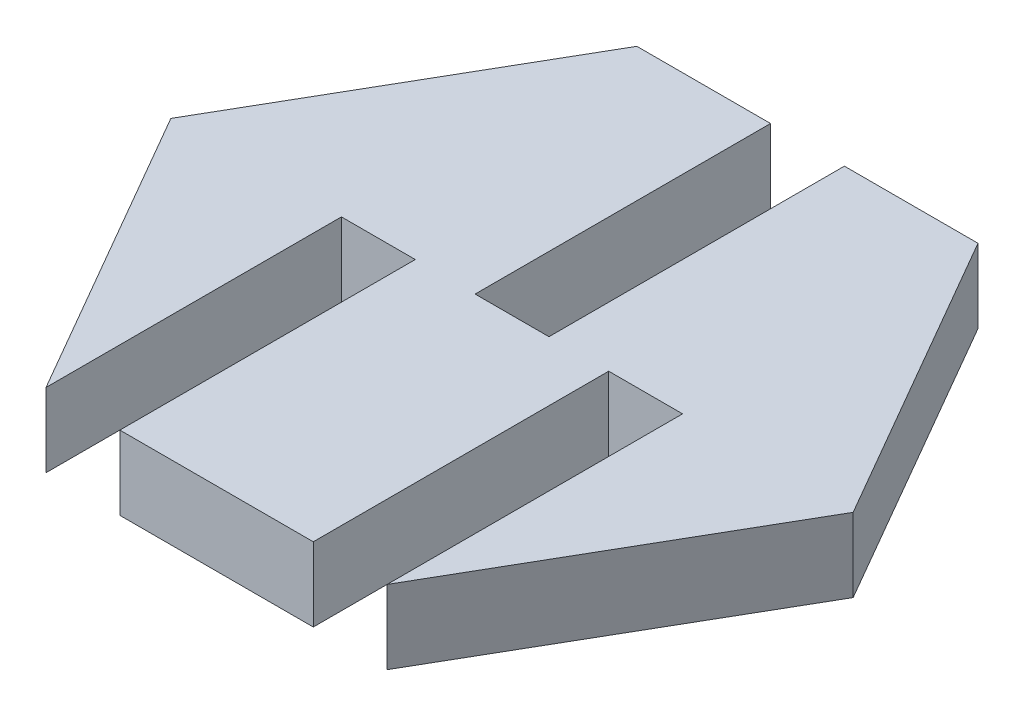
ISO-10303-21;
HEADER;
FILE_DESCRIPTION(('STEP AP214'),'2;1');
FILE_NAME('part.step','',(''),(''),'','','');
FILE_SCHEMA(('AUTOMOTIVE_DESIGN { 1 0 10303 214 1 1 1 1 }'));
ENDSEC;
DATA;
#1=APPLICATION_CONTEXT('core data for automotive mechanical design processes');
#2=APPLICATION_PROTOCOL_DEFINITION('international standard','automotive_design',2000,#1);
#3=PRODUCT_CONTEXT('',#1,'mechanical');
#4=PRODUCT('Part','Part','',(#3));
#5=PRODUCT_RELATED_PRODUCT_CATEGORY('part','',(#4));
#6=PRODUCT_DEFINITION_FORMATION('','',#4);
#7=PRODUCT_DEFINITION_CONTEXT('part definition',#1,'design');
#8=PRODUCT_DEFINITION('design','',#6,#7);
#9=PRODUCT_DEFINITION_SHAPE('','',#8);
#10=(LENGTH_UNIT() NAMED_UNIT(*) SI_UNIT(.MILLI.,.METRE.));
#11=(NAMED_UNIT(*) PLANE_ANGLE_UNIT() SI_UNIT($,.RADIAN.));
#12=(NAMED_UNIT(*) SI_UNIT($,.STERADIAN.) SOLID_ANGLE_UNIT());
#13=UNCERTAINTY_MEASURE_WITH_UNIT(LENGTH_MEASURE(1.E-05),#10,'distance_accuracy_value','');
#14=(GEOMETRIC_REPRESENTATION_CONTEXT(3) GLOBAL_UNCERTAINTY_ASSIGNED_CONTEXT((#13)) GLOBAL_UNIT_ASSIGNED_CONTEXT((#10,
#11,#12)) REPRESENTATION_CONTEXT('',''));
#15=CARTESIAN_POINT('',(0.,0.,0.));
#16=DIRECTION('',(0.,0.,1.));
#17=DIRECTION('',(1.,0.,0.));
#18=AXIS2_PLACEMENT_3D('',#15,#16,#17);
#19=CARTESIAN_POINT('',(5.77350269189625,2.5,-10.));
#20=DIRECTION('',(0.,0.,1.));
#21=DIRECTION('',(1.,0.,0.));
#22=AXIS2_PLACEMENT_3D('',#19,#20,#21);
#23=PLANE('',#22);
#24=DIRECTION('',(-1.,0.,0.));
#25=VECTOR('',#24,1.);
#26=CARTESIAN_POINT('',(5.77350269189625,2.5,-10.));
#27=LINE('',#26,#25);
#28=CARTESIAN_POINT('',(-1.24850269189626,2.5,-10.));
#29=VERTEX_POINT('',#28);
#30=CARTESIAN_POINT('',(-5.77350269189626,2.5,-10.));
#31=VERTEX_POINT('',#30);
#32=EDGE_CURVE('E266',#29,#31,#27,.T.);
#33=ORIENTED_EDGE('',*,*,#32,.F.);
#34=DIRECTION('',(0.,1.,0.));
#35=VECTOR('',#34,1.);
#36=CARTESIAN_POINT('',(-1.24850269189626,2.5,-10.));
#37=LINE('',#36,#35);
#38=CARTESIAN_POINT('',(-1.24850269189626,0.,-10.));
#39=VERTEX_POINT('',#38);
#40=EDGE_CURVE('E158',#39,#29,#37,.T.);
#41=ORIENTED_EDGE('',*,*,#40,.F.);
#42=DIRECTION('',(-1.,0.,0.));
#43=VECTOR('',#42,1.);
#44=CARTESIAN_POINT('',(5.77350269189625,0.,-10.));
#45=LINE('',#44,#43);
#46=CARTESIAN_POINT('',(-5.77350269189626,0.,-10.));
#47=VERTEX_POINT('',#46);
#48=EDGE_CURVE('E288',#39,#47,#45,.T.);
#49=ORIENTED_EDGE('',*,*,#48,.T.);
#50=DIRECTION('',(0.,-1.,0.));
#51=VECTOR('',#50,1.);
#52=CARTESIAN_POINT('',(-5.77350269189626,2.5,-10.));
#53=LINE('',#52,#51);
#54=EDGE_CURVE('E313',#31,#47,#53,.T.);
#55=ORIENTED_EDGE('',*,*,#54,.F.);
#56=EDGE_LOOP('',(#33,#41,#49,#55));
#57=FACE_BOUND('',#56,.T.);
#58=ADVANCED_FACE('F38',(#57),#23,.F.);
#59=CARTESIAN_POINT('',(5.77350269189625,2.5,10.));
#60=DIRECTION('',(-0.866025403784439,0.,-0.5));
#61=DIRECTION('',(-0.5,0.,0.866025403784439));
#62=AXIS2_PLACEMENT_3D('',#59,#60,#61);
#63=PLANE('',#62);
#64=DIRECTION('',(0.5,0.,-0.866025403784439));
#65=VECTOR('',#64,1.);
#66=CARTESIAN_POINT('',(5.77350269189625,0.,10.));
#67=LINE('',#66,#65);
#68=CARTESIAN_POINT('',(5.77350269189625,0.,10.));
#69=VERTEX_POINT('',#68);
#70=CARTESIAN_POINT('',(11.5470053837925,0.,0.));
#71=VERTEX_POINT('',#70);
#72=EDGE_CURVE('E247',#69,#71,#67,.T.);
#73=ORIENTED_EDGE('',*,*,#72,.T.);
#74=DIRECTION('',(0.,-1.,0.));
#75=VECTOR('',#74,1.);
#76=CARTESIAN_POINT('',(11.5470053837925,2.5,0.));
#77=LINE('',#76,#75);
#78=CARTESIAN_POINT('',(11.5470053837925,2.5,0.));
#79=VERTEX_POINT('',#78);
#80=EDGE_CURVE('E11',#79,#71,#77,.T.);
#81=ORIENTED_EDGE('',*,*,#80,.F.);
#82=DIRECTION('',(0.5,0.,-0.866025403784439));
#83=VECTOR('',#82,1.);
#84=CARTESIAN_POINT('',(5.77350269189625,2.5,10.));
#85=LINE('',#84,#83);
#86=CARTESIAN_POINT('',(5.77350269189625,2.5,10.));
#87=VERTEX_POINT('',#86);
#88=EDGE_CURVE('E258',#87,#79,#85,.T.);
#89=ORIENTED_EDGE('',*,*,#88,.F.);
#90=DIRECTION('',(0.,-1.,0.));
#91=VECTOR('',#90,1.);
#92=CARTESIAN_POINT('',(5.77350269189625,2.5,10.));
#93=LINE('',#92,#91);
#94=EDGE_CURVE('E281',#87,#69,#93,.T.);
#95=ORIENTED_EDGE('',*,*,#94,.T.);
#96=EDGE_LOOP('',(#73,#81,#89,#95));
#97=FACE_BOUND('',#96,.T.);
#98=ADVANCED_FACE('F40',(#97),#63,.F.);
#99=CARTESIAN_POINT('',(11.5470053837925,2.5,0.));
#100=DIRECTION('',(-0.866025403784439,0.,0.5));
#101=DIRECTION('',(0.5,0.,0.866025403784439));
#102=AXIS2_PLACEMENT_3D('',#99,#100,#101);
#103=PLANE('',#102);
#104=DIRECTION('',(-0.5,0.,-0.866025403784438));
#105=VECTOR('',#104,1.);
#106=CARTESIAN_POINT('',(11.5470053837925,0.,0.));
#107=LINE('',#106,#105);
#108=CARTESIAN_POINT('',(5.77350269189625,0.,-10.));
#109=VERTEX_POINT('',#108);
#110=EDGE_CURVE('E285',#71,#109,#107,.T.);
#111=ORIENTED_EDGE('',*,*,#110,.T.);
#112=DIRECTION('',(0.,-1.,0.));
#113=VECTOR('',#112,1.);
#114=CARTESIAN_POINT('',(5.77350269189625,2.5,-10.));
#115=LINE('',#114,#113);
#116=CARTESIAN_POINT('',(5.77350269189625,2.5,-10.));
#117=VERTEX_POINT('',#116);
#118=EDGE_CURVE('E47',#117,#109,#115,.T.);
#119=ORIENTED_EDGE('',*,*,#118,.F.);
#120=DIRECTION('',(-0.5,0.,-0.866025403784438));
#121=VECTOR('',#120,1.);
#122=CARTESIAN_POINT('',(11.5470053837925,2.5,0.));
#123=LINE('',#122,#121);
#124=EDGE_CURVE('E262',#79,#117,#123,.T.);
#125=ORIENTED_EDGE('',*,*,#124,.F.);
#126=ORIENTED_EDGE('',*,*,#80,.T.);
#127=EDGE_LOOP('',(#111,#119,#125,#126));
#128=FACE_BOUND('',#127,.T.);
#129=ADVANCED_FACE('F333',(#128),#103,.F.);
#130=CARTESIAN_POINT('',(1.25149730810374,0.,-10.));
#131=VERTEX_POINT('',#130);
#132=EDGE_CURVE('E289',#109,#131,#45,.T.);
#133=ORIENTED_EDGE('',*,*,#132,.T.);
#134=DIRECTION('',(0.,-1.,0.));
#135=VECTOR('',#134,1.);
#136=CARTESIAN_POINT('',(1.25149730810374,2.5,-10.));
#137=LINE('',#136,#135);
#138=CARTESIAN_POINT('',(1.25149730810374,2.5,-10.));
#139=VERTEX_POINT('',#138);
#140=EDGE_CURVE('E172',#139,#131,#137,.T.);
#141=ORIENTED_EDGE('',*,*,#140,.F.);
#142=EDGE_CURVE('E267',#117,#139,#27,.T.);
#143=ORIENTED_EDGE('',*,*,#142,.F.);
#144=ORIENTED_EDGE('',*,*,#118,.T.);
#145=EDGE_LOOP('',(#133,#141,#143,#144));
#146=FACE_BOUND('',#145,.T.);
#147=ADVANCED_FACE('F322',(#146),#23,.F.);
#148=CARTESIAN_POINT('',(-5.77350269189626,2.5,-10.));
#149=DIRECTION('',(0.866025403784439,0.,0.5));
#150=DIRECTION('',(0.5,0.,-0.866025403784439));
#151=AXIS2_PLACEMENT_3D('',#148,#149,#150);
#152=PLANE('',#151);
#153=DIRECTION('',(-0.5,0.,0.866025403784439));
#154=VECTOR('',#153,1.);
#155=CARTESIAN_POINT('',(-5.77350269189626,0.,-10.));
#156=LINE('',#155,#154);
#157=CARTESIAN_POINT('',(-11.5470053837925,0.,0.));
#158=VERTEX_POINT('',#157);
#159=EDGE_CURVE('E293',#47,#158,#156,.T.);
#160=ORIENTED_EDGE('',*,*,#159,.T.);
#161=DIRECTION('',(0.,-1.,0.));
#162=VECTOR('',#161,1.);
#163=CARTESIAN_POINT('',(-11.5470053837925,2.5,0.));
#164=LINE('',#163,#162);
#165=CARTESIAN_POINT('',(-11.5470053837925,2.5,0.));
#166=VERTEX_POINT('',#165);
#167=EDGE_CURVE('E309',#166,#158,#164,.T.);
#168=ORIENTED_EDGE('',*,*,#167,.F.);
#169=DIRECTION('',(-0.5,0.,0.866025403784439));
#170=VECTOR('',#169,1.);
#171=CARTESIAN_POINT('',(-5.77350269189626,2.5,-10.));
#172=LINE('',#171,#170);
#173=EDGE_CURVE('E270',#31,#166,#172,.T.);
#174=ORIENTED_EDGE('',*,*,#173,.F.);
#175=ORIENTED_EDGE('',*,*,#54,.T.);
#176=EDGE_LOOP('',(#160,#168,#174,#175));
#177=FACE_BOUND('',#176,.T.);
#178=ADVANCED_FACE('F360',(#177),#152,.F.);
#179=CARTESIAN_POINT('',(-11.5470053837925,2.5,0.));
#180=DIRECTION('',(0.866025403784439,0.,-0.5));
#181=DIRECTION('',(-0.5,0.,-0.866025403784439));
#182=AXIS2_PLACEMENT_3D('',#179,#180,#181);
#183=PLANE('',#182);
#184=DIRECTION('',(0.5,0.,0.866025403784439));
#185=VECTOR('',#184,1.);
#186=CARTESIAN_POINT('',(-11.5470053837925,0.,0.));
#187=LINE('',#186,#185);
#188=CARTESIAN_POINT('',(-5.77350269189626,0.,10.));
#189=VERTEX_POINT('',#188);
#190=EDGE_CURVE('E296',#158,#189,#187,.T.);
#191=ORIENTED_EDGE('',*,*,#190,.T.);
#192=DIRECTION('',(0.,-1.,0.));
#193=VECTOR('',#192,1.);
#194=CARTESIAN_POINT('',(-5.77350269189626,2.5,10.));
#195=LINE('',#194,#193);
#196=CARTESIAN_POINT('',(-5.77350269189626,2.5,10.));
#197=VERTEX_POINT('',#196);
#198=EDGE_CURVE('E306',#197,#189,#195,.T.);
#199=ORIENTED_EDGE('',*,*,#198,.F.);
#200=DIRECTION('',(0.5,0.,0.866025403784439));
#201=VECTOR('',#200,1.);
#202=CARTESIAN_POINT('',(-11.5470053837925,2.5,0.));
#203=LINE('',#202,#201);
#204=EDGE_CURVE('E273',#166,#197,#203,.T.);
#205=ORIENTED_EDGE('',*,*,#204,.F.);
#206=ORIENTED_EDGE('',*,*,#167,.T.);
#207=EDGE_LOOP('',(#191,#199,#205,#206));
#208=FACE_BOUND('',#207,.T.);
#209=ADVANCED_FACE('F365',(#208),#183,.F.);
#210=CARTESIAN_POINT('',(-5.77350269189626,2.5,10.));
#211=DIRECTION('',(0.,0.,-1.));
#212=DIRECTION('',(-1.,0.,0.));
#213=AXIS2_PLACEMENT_3D('',#210,#211,#212);
#214=PLANE('',#213);
#215=DIRECTION('',(1.,0.,0.));
#216=VECTOR('',#215,1.);
#217=CARTESIAN_POINT('',(-5.77350269189626,0.,10.));
#218=LINE('',#217,#216);
#219=CARTESIAN_POINT('',(-3.27350269189626,0.,10.));
#220=VERTEX_POINT('',#219);
#221=CARTESIAN_POINT('',(3.27350269189626,0.,10.));
#222=VERTEX_POINT('',#221);
#223=EDGE_CURVE('E263',#220,#222,#218,.T.);
#224=ORIENTED_EDGE('',*,*,#223,.T.);
#225=DIRECTION('',(0.,-1.,0.));
#226=VECTOR('',#225,1.);
#227=CARTESIAN_POINT('',(3.27350269189625,2.5,10.));
#228=LINE('',#227,#226);
#229=CARTESIAN_POINT('',(3.27350269189625,2.5,10.));
#230=VERTEX_POINT('',#229);
#231=EDGE_CURVE('E190',#230,#222,#228,.T.);
#232=ORIENTED_EDGE('',*,*,#231,.F.);
#233=DIRECTION('',(1.,0.,0.));
#234=VECTOR('',#233,1.);
#235=CARTESIAN_POINT('',(-5.77350269189626,2.5,10.));
#236=LINE('',#235,#234);
#237=CARTESIAN_POINT('',(-3.27350269189626,2.5,10.));
#238=VERTEX_POINT('',#237);
#239=EDGE_CURVE('E277',#238,#230,#236,.T.);
#240=ORIENTED_EDGE('',*,*,#239,.F.);
#241=DIRECTION('',(0.,1.,0.));
#242=VECTOR('',#241,1.);
#243=CARTESIAN_POINT('',(-3.27350269189626,2.5,10.));
#244=LINE('',#243,#242);
#245=EDGE_CURVE('E215',#220,#238,#244,.T.);
#246=ORIENTED_EDGE('',*,*,#245,.F.);
#247=EDGE_LOOP('',(#224,#232,#240,#246));
#248=FACE_BOUND('',#247,.T.);
#249=ADVANCED_FACE('F386',(#248),#214,.F.);
#250=CARTESIAN_POINT('',(0.,2.5,0.));
#251=DIRECTION('',(0.,1.,0.));
#252=DIRECTION('',(0.,0.,1.));
#253=AXIS2_PLACEMENT_3D('',#250,#251,#252);
#254=PLANE('',#253);
#255=DIRECTION('',(0.,0.,-1.));
#256=VECTOR('',#255,1.);
#257=CARTESIAN_POINT('',(-1.24850269189626,2.5,0.));
#258=LINE('',#257,#256);
#259=CARTESIAN_POINT('',(-1.24850269189626,2.5,0.));
#260=VERTEX_POINT('',#259);
#261=EDGE_CURVE('E153',#260,#29,#258,.T.);
#262=ORIENTED_EDGE('',*,*,#261,.T.);
#263=ORIENTED_EDGE('',*,*,#32,.T.);
#264=ORIENTED_EDGE('',*,*,#173,.T.);
#265=ORIENTED_EDGE('',*,*,#204,.T.);
#266=DIRECTION('',(0.,0.,1.));
#267=VECTOR('',#266,1.);
#268=CARTESIAN_POINT('',(-5.77350269189626,2.5,0.));
#269=LINE('',#268,#267);
#270=CARTESIAN_POINT('',(-5.77350269189626,2.5,0.));
#271=VERTEX_POINT('',#270);
#272=EDGE_CURVE('E244',#271,#197,#269,.T.);
#273=ORIENTED_EDGE('',*,*,#272,.F.);
#274=DIRECTION('',(-1.,0.,0.));
#275=VECTOR('',#274,1.);
#276=CARTESIAN_POINT('',(-5.77350269189626,2.5,0.));
#277=LINE('',#276,#275);
#278=CARTESIAN_POINT('',(-3.27350269189626,2.5,0.));
#279=VERTEX_POINT('',#278);
#280=EDGE_CURVE('E237',#279,#271,#277,.T.);
#281=ORIENTED_EDGE('',*,*,#280,.F.);
#282=DIRECTION('',(0.,0.,1.));
#283=VECTOR('',#282,1.);
#284=CARTESIAN_POINT('',(-3.27350269189626,2.5,0.));
#285=LINE('',#284,#283);
#286=EDGE_CURVE('E248',#279,#238,#285,.T.);
#287=ORIENTED_EDGE('',*,*,#286,.T.);
#288=ORIENTED_EDGE('',*,*,#239,.T.);
#289=DIRECTION('',(0.,0.,1.));
#290=VECTOR('',#289,1.);
#291=CARTESIAN_POINT('',(3.27350269189625,2.5,0.));
#292=LINE('',#291,#290);
#293=CARTESIAN_POINT('',(3.27350269189625,2.5,0.));
#294=VERTEX_POINT('',#293);
#295=EDGE_CURVE('E220',#294,#230,#292,.T.);
#296=ORIENTED_EDGE('',*,*,#295,.F.);
#297=DIRECTION('',(-1.,0.,0.));
#298=VECTOR('',#297,1.);
#299=CARTESIAN_POINT('',(5.77350269189625,2.5,0.));
#300=LINE('',#299,#298);
#301=CARTESIAN_POINT('',(5.77350269189625,2.5,0.));
#302=VERTEX_POINT('',#301);
#303=EDGE_CURVE('E201',#302,#294,#300,.T.);
#304=ORIENTED_EDGE('',*,*,#303,.F.);
#305=DIRECTION('',(0.,0.,1.));
#306=VECTOR('',#305,1.);
#307=CARTESIAN_POINT('',(5.77350269189625,2.5,0.));
#308=LINE('',#307,#306);
#309=EDGE_CURVE('E209',#302,#87,#308,.T.);
#310=ORIENTED_EDGE('',*,*,#309,.T.);
#311=ORIENTED_EDGE('',*,*,#88,.T.);
#312=ORIENTED_EDGE('',*,*,#124,.T.);
#313=ORIENTED_EDGE('',*,*,#142,.T.);
#314=DIRECTION('',(0.,0.,-1.));
#315=VECTOR('',#314,1.);
#316=CARTESIAN_POINT('',(1.25149730810374,2.5,0.));
#317=LINE('',#316,#315);
#318=CARTESIAN_POINT('',(1.25149730810374,2.5,0.));
#319=VERTEX_POINT('',#318);
#320=EDGE_CURVE('E163',#319,#139,#317,.T.);
#321=ORIENTED_EDGE('',*,*,#320,.F.);
#322=DIRECTION('',(1.,0.,0.));
#323=VECTOR('',#322,1.);
#324=CARTESIAN_POINT('',(-1.24850269189626,2.5,0.));
#325=LINE('',#324,#323);
#326=EDGE_CURVE('E167',#260,#319,#325,.T.);
#327=ORIENTED_EDGE('',*,*,#326,.F.);
#328=EDGE_LOOP('',(#262,#263,#264,#265,#273,#281,#287,#288,#296,#304,#310,#311,#312,#313,#321,#327));
#329=FACE_BOUND('',#328,.T.);
#330=ADVANCED_FACE('F174',(#329),#254,.T.);
#331=CARTESIAN_POINT('',(0.,0.,0.));
#332=DIRECTION('',(0.,1.,0.));
#333=DIRECTION('',(0.,0.,1.));
#334=AXIS2_PLACEMENT_3D('',#331,#332,#333);
#335=PLANE('',#334);
#336=ORIENTED_EDGE('',*,*,#48,.F.);
#337=DIRECTION('',(0.,0.,-1.));
#338=VECTOR('',#337,1.);
#339=CARTESIAN_POINT('',(-1.24850269189626,0.,0.));
#340=LINE('',#339,#338);
#341=CARTESIAN_POINT('',(-1.24850269189626,0.,0.));
#342=VERTEX_POINT('',#341);
#343=EDGE_CURVE('E187',#342,#39,#340,.T.);
#344=ORIENTED_EDGE('',*,*,#343,.F.);
#345=DIRECTION('',(-1.,0.,0.));
#346=VECTOR('',#345,1.);
#347=CARTESIAN_POINT('',(-1.24850269189626,0.,0.));
#348=LINE('',#347,#346);
#349=CARTESIAN_POINT('',(1.25149730810374,0.,0.));
#350=VERTEX_POINT('',#349);
#351=EDGE_CURVE('E164',#350,#342,#348,.T.);
#352=ORIENTED_EDGE('',*,*,#351,.F.);
#353=DIRECTION('',(0.,0.,-1.));
#354=VECTOR('',#353,1.);
#355=CARTESIAN_POINT('',(1.25149730810374,0.,0.));
#356=LINE('',#355,#354);
#357=EDGE_CURVE('E191',#350,#131,#356,.T.);
#358=ORIENTED_EDGE('',*,*,#357,.T.);
#359=ORIENTED_EDGE('',*,*,#132,.F.);
#360=ORIENTED_EDGE('',*,*,#110,.F.);
#361=ORIENTED_EDGE('',*,*,#72,.F.);
#362=DIRECTION('',(0.,0.,1.));
#363=VECTOR('',#362,1.);
#364=CARTESIAN_POINT('',(5.77350269189625,0.,0.));
#365=LINE('',#364,#363);
#366=CARTESIAN_POINT('',(5.77350269189625,0.,0.));
#367=VERTEX_POINT('',#366);
#368=EDGE_CURVE('E212',#367,#69,#365,.T.);
#369=ORIENTED_EDGE('',*,*,#368,.F.);
#370=DIRECTION('',(1.,0.,0.));
#371=VECTOR('',#370,1.);
#372=CARTESIAN_POINT('',(5.77350269189625,0.,0.));
#373=LINE('',#372,#371);
#374=CARTESIAN_POINT('',(3.27350269189625,0.,0.));
#375=VERTEX_POINT('',#374);
#376=EDGE_CURVE('E206',#375,#367,#373,.T.);
#377=ORIENTED_EDGE('',*,*,#376,.F.);
#378=DIRECTION('',(0.,0.,1.));
#379=VECTOR('',#378,1.);
#380=CARTESIAN_POINT('',(3.27350269189626,0.,0.));
#381=LINE('',#380,#379);
#382=EDGE_CURVE('E216',#375,#222,#381,.T.);
#383=ORIENTED_EDGE('',*,*,#382,.T.);
#384=ORIENTED_EDGE('',*,*,#223,.F.);
#385=DIRECTION('',(0.,0.,1.));
#386=VECTOR('',#385,1.);
#387=CARTESIAN_POINT('',(-3.27350269189626,0.,0.));
#388=LINE('',#387,#386);
#389=CARTESIAN_POINT('',(-3.27350269189626,0.,0.));
#390=VERTEX_POINT('',#389);
#391=EDGE_CURVE('E252',#390,#220,#388,.T.);
#392=ORIENTED_EDGE('',*,*,#391,.F.);
#393=DIRECTION('',(1.,0.,0.));
#394=VECTOR('',#393,1.);
#395=CARTESIAN_POINT('',(-5.77350269189626,0.,0.));
#396=LINE('',#395,#394);
#397=CARTESIAN_POINT('',(-5.77350269189626,0.,0.));
#398=VERTEX_POINT('',#397);
#399=EDGE_CURVE('E229',#398,#390,#396,.T.);
#400=ORIENTED_EDGE('',*,*,#399,.F.);
#401=DIRECTION('',(0.,0.,1.));
#402=VECTOR('',#401,1.);
#403=CARTESIAN_POINT('',(-5.77350269189626,0.,0.));
#404=LINE('',#403,#402);
#405=EDGE_CURVE('E241',#398,#189,#404,.T.);
#406=ORIENTED_EDGE('',*,*,#405,.T.);
#407=ORIENTED_EDGE('',*,*,#190,.F.);
#408=ORIENTED_EDGE('',*,*,#159,.F.);
#409=EDGE_LOOP('',(#336,#344,#352,#358,#359,#360,#361,#369,#377,#383,#384,#392,#400,#406,#407,#408));
#410=FACE_BOUND('',#409,.T.);
#411=ADVANCED_FACE('F327',(#410),#335,.F.);
#412=CARTESIAN_POINT('',(-5.77350269189626,2.5,0.));
#413=DIRECTION('',(-1.,0.,0.));
#414=DIRECTION('',(0.,0.,1.));
#415=AXIS2_PLACEMENT_3D('',#412,#413,#414);
#416=PLANE('',#415);
#417=ORIENTED_EDGE('',*,*,#198,.T.);
#418=ORIENTED_EDGE('',*,*,#405,.F.);
#419=DIRECTION('',(0.,-1.,0.));
#420=VECTOR('',#419,1.);
#421=CARTESIAN_POINT('',(-5.77350269189626,2.5,0.));
#422=LINE('',#421,#420);
#423=EDGE_CURVE('E226',#271,#398,#422,.T.);
#424=ORIENTED_EDGE('',*,*,#423,.F.);
#425=ORIENTED_EDGE('',*,*,#272,.T.);
#426=EDGE_LOOP('',(#417,#418,#424,#425));
#427=FACE_BOUND('',#426,.T.);
#428=ADVANCED_FACE('F411',(#427),#416,.F.);
#429=CARTESIAN_POINT('',(-3.27350269189626,2.5,0.));
#430=DIRECTION('',(1.,0.,0.));
#431=DIRECTION('',(0.,1.,0.));
#432=AXIS2_PLACEMENT_3D('',#429,#430,#431);
#433=PLANE('',#432);
#434=ORIENTED_EDGE('',*,*,#245,.T.);
#435=ORIENTED_EDGE('',*,*,#286,.F.);
#436=DIRECTION('',(0.,1.,0.));
#437=VECTOR('',#436,1.);
#438=CARTESIAN_POINT('',(-3.27350269189626,2.5,0.));
#439=LINE('',#438,#437);
#440=EDGE_CURVE('E233',#390,#279,#439,.T.);
#441=ORIENTED_EDGE('',*,*,#440,.F.);
#442=ORIENTED_EDGE('',*,*,#391,.T.);
#443=EDGE_LOOP('',(#434,#435,#441,#442));
#444=FACE_BOUND('',#443,.T.);
#445=ADVANCED_FACE('F420',(#444),#433,.F.);
#446=CARTESIAN_POINT('',(0.,0.,0.));
#447=DIRECTION('',(0.,0.,1.));
#448=DIRECTION('',(1.,0.,0.));
#449=AXIS2_PLACEMENT_3D('',#446,#447,#448);
#450=PLANE('',#449);
#451=ORIENTED_EDGE('',*,*,#423,.T.);
#452=ORIENTED_EDGE('',*,*,#399,.T.);
#453=ORIENTED_EDGE('',*,*,#440,.T.);
#454=ORIENTED_EDGE('',*,*,#280,.T.);
#455=EDGE_LOOP('',(#451,#452,#453,#454));
#456=FACE_BOUND('',#455,.T.);
#457=ADVANCED_FACE('F427',(#456),#450,.T.);
#458=CARTESIAN_POINT('',(5.77350269189625,2.5,0.));
#459=DIRECTION('',(1.,0.,0.));
#460=DIRECTION('',(0.,0.,-1.));
#461=AXIS2_PLACEMENT_3D('',#458,#459,#460);
#462=PLANE('',#461);
#463=ORIENTED_EDGE('',*,*,#94,.F.);
#464=ORIENTED_EDGE('',*,*,#309,.F.);
#465=DIRECTION('',(0.,1.,0.));
#466=VECTOR('',#465,1.);
#467=CARTESIAN_POINT('',(5.77350269189625,2.5,0.));
#468=LINE('',#467,#466);
#469=EDGE_CURVE('E197',#367,#302,#468,.T.);
#470=ORIENTED_EDGE('',*,*,#469,.F.);
#471=ORIENTED_EDGE('',*,*,#368,.T.);
#472=EDGE_LOOP('',(#463,#464,#470,#471));
#473=FACE_BOUND('',#472,.T.);
#474=ADVANCED_FACE('F338',(#473),#462,.F.);
#475=CARTESIAN_POINT('',(3.27350269189625,2.5,0.));
#476=DIRECTION('',(-1.,0.,0.));
#477=DIRECTION('',(0.,-1.,0.));
#478=AXIS2_PLACEMENT_3D('',#475,#476,#477);
#479=PLANE('',#478);
#480=ORIENTED_EDGE('',*,*,#231,.T.);
#481=ORIENTED_EDGE('',*,*,#382,.F.);
#482=DIRECTION('',(0.,-1.,0.));
#483=VECTOR('',#482,1.);
#484=CARTESIAN_POINT('',(3.27350269189625,2.5,0.));
#485=LINE('',#484,#483);
#486=EDGE_CURVE('E62',#294,#375,#485,.T.);
#487=ORIENTED_EDGE('',*,*,#486,.F.);
#488=ORIENTED_EDGE('',*,*,#295,.T.);
#489=EDGE_LOOP('',(#480,#481,#487,#488));
#490=FACE_BOUND('',#489,.T.);
#491=ADVANCED_FACE('F342',(#490),#479,.F.);
#492=CARTESIAN_POINT('',(0.,0.,0.));
#493=DIRECTION('',(0.,0.,-1.));
#494=DIRECTION('',(-1.,0.,0.));
#495=AXIS2_PLACEMENT_3D('',#492,#493,#494);
#496=PLANE('',#495);
#497=ORIENTED_EDGE('',*,*,#469,.T.);
#498=ORIENTED_EDGE('',*,*,#303,.T.);
#499=ORIENTED_EDGE('',*,*,#486,.T.);
#500=ORIENTED_EDGE('',*,*,#376,.T.);
#501=EDGE_LOOP('',(#497,#498,#499,#500));
#502=FACE_BOUND('',#501,.T.);
#503=ADVANCED_FACE('F340',(#502),#496,.F.);
#504=CARTESIAN_POINT('',(-1.24850269189626,2.5,0.));
#505=DIRECTION('',(-1.,0.,0.));
#506=DIRECTION('',(0.,-1.,0.));
#507=AXIS2_PLACEMENT_3D('',#504,#505,#506);
#508=PLANE('',#507);
#509=ORIENTED_EDGE('',*,*,#40,.T.);
#510=ORIENTED_EDGE('',*,*,#261,.F.);
#511=DIRECTION('',(0.,1.,0.));
#512=VECTOR('',#511,1.);
#513=CARTESIAN_POINT('',(-1.24850269189626,2.5,0.));
#514=LINE('',#513,#512);
#515=EDGE_CURVE('E156',#342,#260,#514,.T.);
#516=ORIENTED_EDGE('',*,*,#515,.F.);
#517=ORIENTED_EDGE('',*,*,#343,.T.);
#518=EDGE_LOOP('',(#509,#510,#516,#517));
#519=FACE_BOUND('',#518,.T.);
#520=ADVANCED_FACE('F155',(#519),#508,.F.);
#521=CARTESIAN_POINT('',(1.25149730810374,2.5,0.));
#522=DIRECTION('',(1.,0.,0.));
#523=DIRECTION('',(0.,1.,0.));
#524=AXIS2_PLACEMENT_3D('',#521,#522,#523);
#525=PLANE('',#524);
#526=ORIENTED_EDGE('',*,*,#140,.T.);
#527=ORIENTED_EDGE('',*,*,#357,.F.);
#528=DIRECTION('',(0.,-1.,0.));
#529=VECTOR('',#528,1.);
#530=CARTESIAN_POINT('',(1.25149730810374,2.5,0.));
#531=LINE('',#530,#529);
#532=EDGE_CURVE('E54',#319,#350,#531,.T.);
#533=ORIENTED_EDGE('',*,*,#532,.F.);
#534=ORIENTED_EDGE('',*,*,#320,.T.);
#535=EDGE_LOOP('',(#526,#527,#533,#534));
#536=FACE_BOUND('',#535,.T.);
#537=ADVANCED_FACE('F330',(#536),#525,.F.);
#538=CARTESIAN_POINT('',(0.,0.,0.));
#539=DIRECTION('',(0.,0.,1.));
#540=DIRECTION('',(1.,0.,0.));
#541=AXIS2_PLACEMENT_3D('',#538,#539,#540);
#542=PLANE('',#541);
#543=ORIENTED_EDGE('',*,*,#515,.T.);
#544=ORIENTED_EDGE('',*,*,#326,.T.);
#545=ORIENTED_EDGE('',*,*,#532,.T.);
#546=ORIENTED_EDGE('',*,*,#351,.T.);
#547=EDGE_LOOP('',(#543,#544,#545,#546));
#548=FACE_BOUND('',#547,.T.);
#549=ADVANCED_FACE('F166',(#548),#542,.F.);
#550=CLOSED_SHELL('',(#58,#98,#129,#147,#178,#209,#249,#330,#411,#428,#445,#457,#474,#491,#503,
#520,#537,#549));
#551=MANIFOLD_SOLID_BREP('B2',#550);
#552=ADVANCED_BREP_SHAPE_REPRESENTATION('',(#18,#551),#14);
#553=SHAPE_DEFINITION_REPRESENTATION(#9,#552);
ENDSEC;
END-ISO-10303-21;
